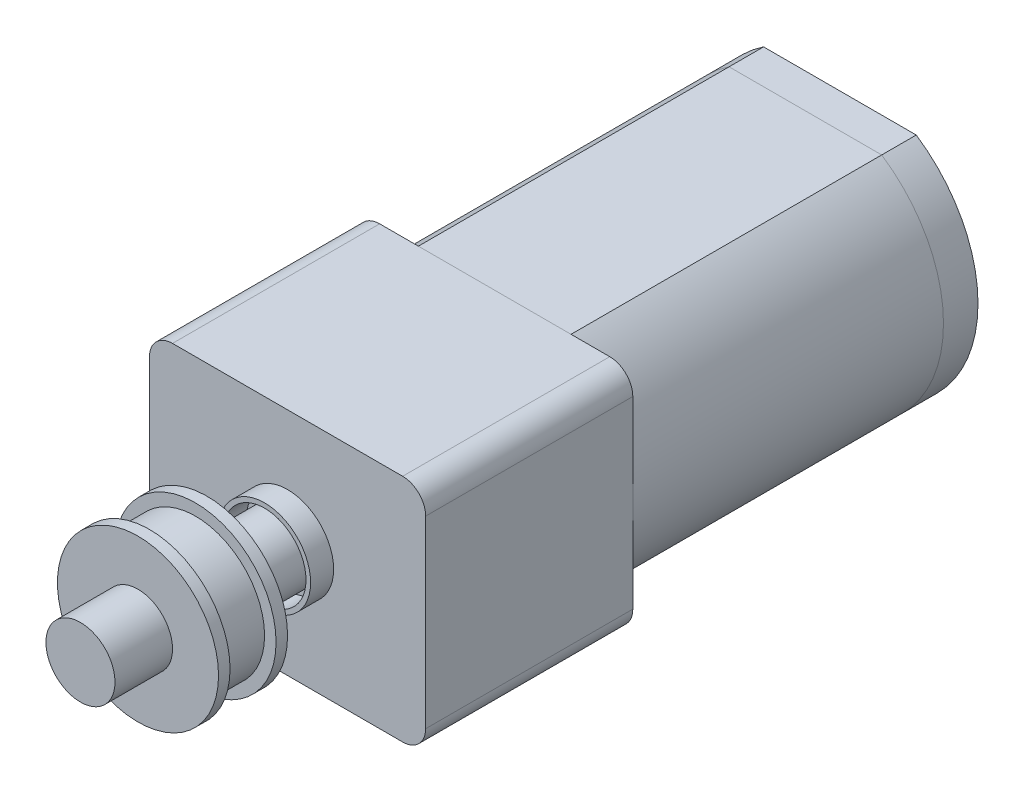
ISO-10303-21;
HEADER;
FILE_DESCRIPTION(('STEP AP214'),'2;1');
FILE_NAME('part.step','',(''),(''),'','','');
FILE_SCHEMA(('AUTOMOTIVE_DESIGN { 1 0 10303 214 1 1 1 1 }'));
ENDSEC;
DATA;
#1=APPLICATION_CONTEXT('core data for automotive mechanical design processes');
#2=APPLICATION_PROTOCOL_DEFINITION('international standard','automotive_design',2000,#1);
#3=PRODUCT_CONTEXT('',#1,'mechanical');
#4=PRODUCT('Part','Part','',(#3));
#5=PRODUCT_RELATED_PRODUCT_CATEGORY('part','',(#4));
#6=PRODUCT_DEFINITION_FORMATION('','',#4);
#7=PRODUCT_DEFINITION_CONTEXT('part definition',#1,'design');
#8=PRODUCT_DEFINITION('design','',#6,#7);
#9=PRODUCT_DEFINITION_SHAPE('','',#8);
#10=(LENGTH_UNIT() NAMED_UNIT(*) SI_UNIT(.MILLI.,.METRE.));
#11=(NAMED_UNIT(*) PLANE_ANGLE_UNIT() SI_UNIT($,.RADIAN.));
#12=(NAMED_UNIT(*) SI_UNIT($,.STERADIAN.) SOLID_ANGLE_UNIT());
#13=UNCERTAINTY_MEASURE_WITH_UNIT(LENGTH_MEASURE(1.E-05),#10,'distance_accuracy_value','');
#14=(GEOMETRIC_REPRESENTATION_CONTEXT(3) GLOBAL_UNCERTAINTY_ASSIGNED_CONTEXT((#13)) GLOBAL_UNIT_ASSIGNED_CONTEXT((#10,
#11,#12)) REPRESENTATION_CONTEXT('',''));
#15=CARTESIAN_POINT('',(0.,0.,0.));
#16=DIRECTION('',(0.,0.,1.));
#17=DIRECTION('',(1.,0.,0.));
#18=AXIS2_PLACEMENT_3D('',#15,#16,#17);
#19=CARTESIAN_POINT('',(0.,0.,26.));
#20=DIRECTION('',(0.,0.,-1.));
#21=DIRECTION('',(-1.,0.,0.));
#22=AXIS2_PLACEMENT_3D('',#19,#20,#21);
#23=PLANE('',#22);
#24=CARTESIAN_POINT('',(0.,0.,26.));
#25=DIRECTION('',(0.,0.,1.));
#26=DIRECTION('',(1.,0.,0.));
#27=AXIS2_PLACEMENT_3D('',#24,#25,#26);
#28=CIRCLE('',#27,3.5);
#29=CARTESIAN_POINT('',(3.5,0.,26.));
#30=VERTEX_POINT('',#29);
#31=EDGE_CURVE('E11',#30,#30,#28,.T.);
#32=ORIENTED_EDGE('',*,*,#31,.F.);
#33=EDGE_LOOP('',(#32));
#34=FACE_BOUND('',#33,.T.);
#35=ADVANCED_FACE('F50',(#34),#23,.T.);
#36=CARTESIAN_POINT('',(0.,0.,31.5));
#37=DIRECTION('',(0.,0.,1.));
#38=DIRECTION('',(1.,0.,0.));
#39=AXIS2_PLACEMENT_3D('',#36,#37,#38);
#40=CYLINDRICAL_SURFACE('',#39,3.5);
#41=ORIENTED_EDGE('',*,*,#31,.T.);
#42=EDGE_LOOP('',(#41));
#43=FACE_BOUND('',#42,.T.);
#44=CARTESIAN_POINT('',(0.,0.,26.5));
#45=DIRECTION('',(0.,0.,1.));
#46=DIRECTION('',(1.,0.,0.));
#47=AXIS2_PLACEMENT_3D('',#44,#45,#46);
#48=CIRCLE('',#47,3.5);
#49=CARTESIAN_POINT('',(3.5,0.,26.5));
#50=VERTEX_POINT('',#49);
#51=EDGE_CURVE('E56',#50,#50,#48,.T.);
#52=ORIENTED_EDGE('',*,*,#51,.F.);
#53=EDGE_LOOP('',(#52));
#54=FACE_BOUND('',#53,.T.);
#55=ADVANCED_FACE('F92',(#43,#54),#40,.T.);
#56=CARTESIAN_POINT('',(3.5,0.,26.5));
#57=DIRECTION('',(0.,0.,1.));
#58=DIRECTION('',(1.,0.,0.));
#59=AXIS2_PLACEMENT_3D('',#56,#57,#58);
#60=PLANE('',#59);
#61=ORIENTED_EDGE('',*,*,#51,.T.);
#62=EDGE_LOOP('',(#61));
#63=FACE_BOUND('',#62,.T.);
#64=CARTESIAN_POINT('',(0.,0.,26.5));
#65=DIRECTION('',(0.,0.,1.));
#66=DIRECTION('',(1.,0.,0.));
#67=AXIS2_PLACEMENT_3D('',#64,#65,#66);
#68=CIRCLE('',#67,3.);
#69=CARTESIAN_POINT('',(3.,0.,26.5));
#70=VERTEX_POINT('',#69);
#71=EDGE_CURVE('E60',#70,#70,#68,.T.);
#72=ORIENTED_EDGE('',*,*,#71,.F.);
#73=EDGE_LOOP('',(#72));
#74=FACE_BOUND('',#73,.T.);
#75=ADVANCED_FACE('F97',(#63,#74),#60,.T.);
#76=CARTESIAN_POINT('',(0.,0.,31.5));
#77=DIRECTION('',(0.,0.,1.));
#78=DIRECTION('',(1.,0.,0.));
#79=AXIS2_PLACEMENT_3D('',#76,#77,#78);
#80=CYLINDRICAL_SURFACE('',#79,3.);
#81=ORIENTED_EDGE('',*,*,#71,.T.);
#82=EDGE_LOOP('',(#81));
#83=FACE_BOUND('',#82,.T.);
#84=CARTESIAN_POINT('',(0.,0.,28.5));
#85=DIRECTION('',(0.,0.,1.));
#86=DIRECTION('',(1.,0.,0.));
#87=AXIS2_PLACEMENT_3D('',#84,#85,#86);
#88=CIRCLE('',#87,3.);
#89=CARTESIAN_POINT('',(3.,0.,28.5));
#90=VERTEX_POINT('',#89);
#91=EDGE_CURVE('E64',#90,#90,#88,.T.);
#92=ORIENTED_EDGE('',*,*,#91,.F.);
#93=EDGE_LOOP('',(#92));
#94=FACE_BOUND('',#93,.T.);
#95=ADVANCED_FACE('F88',(#83,#94),#80,.T.);
#96=CARTESIAN_POINT('',(3.5,0.,28.5));
#97=DIRECTION('',(0.,0.,-1.));
#98=DIRECTION('',(-1.,0.,0.));
#99=AXIS2_PLACEMENT_3D('',#96,#97,#98);
#100=PLANE('',#99);
#101=ORIENTED_EDGE('',*,*,#91,.T.);
#102=EDGE_LOOP('',(#101));
#103=FACE_BOUND('',#102,.T.);
#104=CARTESIAN_POINT('',(0.,0.,28.5));
#105=DIRECTION('',(0.,0.,1.));
#106=DIRECTION('',(1.,0.,0.));
#107=AXIS2_PLACEMENT_3D('',#104,#105,#106);
#108=CIRCLE('',#107,3.5);
#109=CARTESIAN_POINT('',(3.5,0.,28.5));
#110=VERTEX_POINT('',#109);
#111=EDGE_CURVE('E69',#110,#110,#108,.T.);
#112=ORIENTED_EDGE('',*,*,#111,.F.);
#113=EDGE_LOOP('',(#112));
#114=FACE_BOUND('',#113,.T.);
#115=ADVANCED_FACE('F80',(#103,#114),#100,.T.);
#116=CARTESIAN_POINT('',(0.,0.,31.5));
#117=DIRECTION('',(0.,0.,1.));
#118=DIRECTION('',(1.,0.,0.));
#119=AXIS2_PLACEMENT_3D('',#116,#117,#118);
#120=CYLINDRICAL_SURFACE('',#119,3.5);
#121=ORIENTED_EDGE('',*,*,#111,.T.);
#122=EDGE_LOOP('',(#121));
#123=FACE_BOUND('',#122,.T.);
#124=CARTESIAN_POINT('',(0.,0.,29.));
#125=DIRECTION('',(0.,0.,1.));
#126=DIRECTION('',(1.,0.,0.));
#127=AXIS2_PLACEMENT_3D('',#124,#125,#126);
#128=CIRCLE('',#127,3.5);
#129=CARTESIAN_POINT('',(3.5,0.,29.));
#130=VERTEX_POINT('',#129);
#131=EDGE_CURVE('E72',#130,#130,#128,.T.);
#132=ORIENTED_EDGE('',*,*,#131,.F.);
#133=EDGE_LOOP('',(#132));
#134=FACE_BOUND('',#133,.T.);
#135=ADVANCED_FACE('F78',(#123,#134),#120,.T.);
#136=CARTESIAN_POINT('',(0.,0.,29.));
#137=DIRECTION('',(0.,0.,1.));
#138=DIRECTION('',(1.,0.,0.));
#139=AXIS2_PLACEMENT_3D('',#136,#137,#138);
#140=PLANE('',#139);
#141=ORIENTED_EDGE('',*,*,#131,.T.);
#142=EDGE_LOOP('',(#141));
#143=FACE_BOUND('',#142,.T.);
#144=ADVANCED_FACE('F76',(#143),#140,.T.);
#145=CLOSED_SHELL('',(#35,#55,#75,#95,#115,#135,#144));
#146=MANIFOLD_SOLID_BREP('B2',#145);
#147=CARTESIAN_POINT('',(0.,0.,-1.5));
#148=DIRECTION('',(0.,0.,1.));
#149=DIRECTION('',(1.,0.,0.));
#150=AXIS2_PLACEMENT_3D('',#147,#148,#149);
#151=CYLINDRICAL_SURFACE('',#150,6.);
#152=CARTESIAN_POINT('',(0.,0.,0.));
#153=DIRECTION('',(0.,0.,-1.));
#154=DIRECTION('',(-1.,0.,0.));
#155=AXIS2_PLACEMENT_3D('',#152,#153,#154);
#156=CIRCLE('',#155,6.);
#157=CARTESIAN_POINT('',(-3.3166247903554,-5.,0.));
#158=VERTEX_POINT('',#157);
#159=CARTESIAN_POINT('',(-3.3166247903554,5.,0.));
#160=VERTEX_POINT('',#159);
#161=EDGE_CURVE('E224',#158,#160,#156,.T.);
#162=ORIENTED_EDGE('',*,*,#161,.T.);
#163=DIRECTION('',(0.,0.,1.));
#164=VECTOR('',#163,1.);
#165=CARTESIAN_POINT('',(-3.3166247903554,5.,-1.5));
#166=LINE('',#165,#164);
#167=CARTESIAN_POINT('',(-3.3166247903554,5.,-1.5));
#168=VERTEX_POINT('',#167);
#169=EDGE_CURVE('E166',#168,#160,#166,.T.);
#170=ORIENTED_EDGE('',*,*,#169,.F.);
#171=CARTESIAN_POINT('',(0.,0.,-1.5));
#172=DIRECTION('',(0.,0.,-1.));
#173=DIRECTION('',(-1.,0.,0.));
#174=AXIS2_PLACEMENT_3D('',#171,#172,#173);
#175=CIRCLE('',#174,6.);
#176=CARTESIAN_POINT('',(-3.3166247903554,-5.,-1.5));
#177=VERTEX_POINT('',#176);
#178=EDGE_CURVE('E210',#177,#168,#175,.T.);
#179=ORIENTED_EDGE('',*,*,#178,.F.);
#180=DIRECTION('',(0.,0.,1.));
#181=VECTOR('',#180,1.);
#182=CARTESIAN_POINT('',(-3.3166247903554,-5.,-1.5));
#183=LINE('',#182,#181);
#184=EDGE_CURVE('E220',#177,#158,#183,.T.);
#185=ORIENTED_EDGE('',*,*,#184,.T.);
#186=EDGE_LOOP('',(#162,#170,#179,#185));
#187=FACE_BOUND('',#186,.T.);
#188=ADVANCED_FACE('F158',(#187),#151,.T.);
#189=CARTESIAN_POINT('',(-3.3166247903554,5.,-1.5));
#190=DIRECTION('',(0.,-1.,0.));
#191=DIRECTION('',(1.,0.,0.));
#192=AXIS2_PLACEMENT_3D('',#189,#190,#191);
#193=PLANE('',#192);
#194=DIRECTION('',(1.,0.,0.));
#195=VECTOR('',#194,1.);
#196=CARTESIAN_POINT('',(-3.3166247903554,5.,0.));
#197=LINE('',#196,#195);
#198=CARTESIAN_POINT('',(3.3166247903554,5.,0.));
#199=VERTEX_POINT('',#198);
#200=EDGE_CURVE('E215',#160,#199,#197,.T.);
#201=ORIENTED_EDGE('',*,*,#200,.T.);
#202=DIRECTION('',(0.,0.,1.));
#203=VECTOR('',#202,1.);
#204=CARTESIAN_POINT('',(3.3166247903554,5.,-1.5));
#205=LINE('',#204,#203);
#206=CARTESIAN_POINT('',(3.3166247903554,5.,-1.5));
#207=VERTEX_POINT('',#206);
#208=EDGE_CURVE('E213',#207,#199,#205,.T.);
#209=ORIENTED_EDGE('',*,*,#208,.F.);
#210=DIRECTION('',(1.,0.,0.));
#211=VECTOR('',#210,1.);
#212=CARTESIAN_POINT('',(-3.3166247903554,5.,-1.5));
#213=LINE('',#212,#211);
#214=EDGE_CURVE('E205',#168,#207,#213,.T.);
#215=ORIENTED_EDGE('',*,*,#214,.F.);
#216=ORIENTED_EDGE('',*,*,#169,.T.);
#217=EDGE_LOOP('',(#201,#209,#215,#216));
#218=FACE_BOUND('',#217,.T.);
#219=ADVANCED_FACE('F214',(#218),#193,.F.);
#220=CARTESIAN_POINT('',(0.,0.,-1.5));
#221=DIRECTION('',(0.,0.,1.));
#222=DIRECTION('',(1.,0.,0.));
#223=AXIS2_PLACEMENT_3D('',#220,#221,#222);
#224=CYLINDRICAL_SURFACE('',#223,6.);
#225=CARTESIAN_POINT('',(0.,0.,0.));
#226=DIRECTION('',(0.,0.,-1.));
#227=DIRECTION('',(-1.,0.,0.));
#228=AXIS2_PLACEMENT_3D('',#225,#226,#227);
#229=CIRCLE('',#228,6.);
#230=CARTESIAN_POINT('',(3.3166247903554,-5.,0.));
#231=VERTEX_POINT('',#230);
#232=EDGE_CURVE('E191',#199,#231,#229,.T.);
#233=ORIENTED_EDGE('',*,*,#232,.T.);
#234=DIRECTION('',(0.,0.,1.));
#235=VECTOR('',#234,1.);
#236=CARTESIAN_POINT('',(3.3166247903554,-5.,-1.5));
#237=LINE('',#236,#235);
#238=CARTESIAN_POINT('',(3.3166247903554,-5.,-1.5));
#239=VERTEX_POINT('',#238);
#240=EDGE_CURVE('E216',#239,#231,#237,.T.);
#241=ORIENTED_EDGE('',*,*,#240,.F.);
#242=CARTESIAN_POINT('',(0.,0.,-1.5));
#243=DIRECTION('',(0.,0.,-1.));
#244=DIRECTION('',(-1.,0.,0.));
#245=AXIS2_PLACEMENT_3D('',#242,#243,#244);
#246=CIRCLE('',#245,6.);
#247=EDGE_CURVE('E208',#207,#239,#246,.T.);
#248=ORIENTED_EDGE('',*,*,#247,.F.);
#249=ORIENTED_EDGE('',*,*,#208,.T.);
#250=EDGE_LOOP('',(#233,#241,#248,#249));
#251=FACE_BOUND('',#250,.T.);
#252=ADVANCED_FACE('F218',(#251),#224,.T.);
#253=CARTESIAN_POINT('',(3.3166247903554,-5.,-1.5));
#254=DIRECTION('',(0.,1.,0.));
#255=DIRECTION('',(-1.,0.,0.));
#256=AXIS2_PLACEMENT_3D('',#253,#254,#255);
#257=PLANE('',#256);
#258=DIRECTION('',(-1.,0.,0.));
#259=VECTOR('',#258,1.);
#260=CARTESIAN_POINT('',(3.3166247903554,-5.,0.));
#261=LINE('',#260,#259);
#262=EDGE_CURVE('E197',#231,#158,#261,.T.);
#263=ORIENTED_EDGE('',*,*,#262,.T.);
#264=ORIENTED_EDGE('',*,*,#184,.F.);
#265=DIRECTION('',(-1.,0.,0.));
#266=VECTOR('',#265,1.);
#267=CARTESIAN_POINT('',(3.3166247903554,-5.,-1.5));
#268=LINE('',#267,#266);
#269=EDGE_CURVE('E174',#239,#177,#268,.T.);
#270=ORIENTED_EDGE('',*,*,#269,.F.);
#271=ORIENTED_EDGE('',*,*,#240,.T.);
#272=EDGE_LOOP('',(#263,#264,#270,#271));
#273=FACE_BOUND('',#272,.T.);
#274=ADVANCED_FACE('F246',(#273),#257,.F.);
#275=CARTESIAN_POINT('',(0.,0.,-1.5));
#276=DIRECTION('',(0.,0.,-1.));
#277=DIRECTION('',(-1.,0.,0.));
#278=AXIS2_PLACEMENT_3D('',#275,#276,#277);
#279=PLANE('',#278);
#280=CARTESIAN_POINT('',(0.,0.,-1.5));
#281=DIRECTION('',(0.,0.,-1.));
#282=DIRECTION('',(-1.,0.,0.));
#283=AXIS2_PLACEMENT_3D('',#280,#281,#282);
#284=CIRCLE('',#283,2.5);
#285=CARTESIAN_POINT('',(-2.5,0.,-1.5));
#286=VERTEX_POINT('',#285);
#287=EDGE_CURVE('E315',#286,#286,#284,.T.);
#288=ORIENTED_EDGE('',*,*,#287,.F.);
#289=EDGE_LOOP('',(#288));
#290=FACE_BOUND('',#289,.T.);
#291=ORIENTED_EDGE('',*,*,#178,.T.);
#292=ORIENTED_EDGE('',*,*,#214,.T.);
#293=ORIENTED_EDGE('',*,*,#247,.T.);
#294=ORIENTED_EDGE('',*,*,#269,.T.);
#295=EDGE_LOOP('',(#291,#292,#293,#294));
#296=FACE_BOUND('',#295,.T.);
#297=ADVANCED_FACE('F206',(#290,#296),#279,.T.);
#298=CARTESIAN_POINT('',(0.,0.,0.));
#299=DIRECTION('',(0.,0.,-1.));
#300=DIRECTION('',(-1.,0.,0.));
#301=AXIS2_PLACEMENT_3D('',#298,#299,#300);
#302=PLANE('',#301);
#303=ORIENTED_EDGE('',*,*,#161,.F.);
#304=ORIENTED_EDGE('',*,*,#262,.F.);
#305=ORIENTED_EDGE('',*,*,#232,.F.);
#306=ORIENTED_EDGE('',*,*,#200,.F.);
#307=EDGE_LOOP('',(#303,#304,#305,#306));
#308=FACE_BOUND('',#307,.T.);
#309=ADVANCED_FACE('F235',(#308),#302,.F.);
#310=CARTESIAN_POINT('',(0.,0.,-3.));
#311=DIRECTION('',(0.,0.,-1.));
#312=DIRECTION('',(-1.,0.,0.));
#313=AXIS2_PLACEMENT_3D('',#310,#311,#312);
#314=PLANE('',#313);
#315=CARTESIAN_POINT('',(0.,0.,-3.));
#316=DIRECTION('',(0.,0.,-1.));
#317=DIRECTION('',(-1.,0.,0.));
#318=AXIS2_PLACEMENT_3D('',#315,#316,#317);
#319=CIRCLE('',#318,2.5);
#320=CARTESIAN_POINT('',(-2.5,0.,-3.));
#321=VERTEX_POINT('',#320);
#322=EDGE_CURVE('E227',#321,#321,#319,.T.);
#323=ORIENTED_EDGE('',*,*,#322,.T.);
#324=EDGE_LOOP('',(#323));
#325=FACE_BOUND('',#324,.T.);
#326=CARTESIAN_POINT('',(0.,0.,-3.));
#327=DIRECTION('',(0.,0.,-1.));
#328=DIRECTION('',(-1.,0.,0.));
#329=AXIS2_PLACEMENT_3D('',#326,#327,#328);
#330=CIRCLE('',#329,1.5);
#331=CARTESIAN_POINT('',(-1.5,0.,-3.));
#332=VERTEX_POINT('',#331);
#333=EDGE_CURVE('E313',#332,#332,#330,.T.);
#334=ORIENTED_EDGE('',*,*,#333,.F.);
#335=EDGE_LOOP('',(#334));
#336=FACE_BOUND('',#335,.T.);
#337=ADVANCED_FACE('F237',(#325,#336),#314,.T.);
#338=CARTESIAN_POINT('',(0.,0.,-3.));
#339=DIRECTION('',(0.,0.,1.));
#340=DIRECTION('',(1.,0.,0.));
#341=AXIS2_PLACEMENT_3D('',#338,#339,#340);
#342=CYLINDRICAL_SURFACE('',#341,2.5);
#343=ORIENTED_EDGE('',*,*,#322,.F.);
#344=EDGE_LOOP('',(#343));
#345=FACE_BOUND('',#344,.T.);
#346=ORIENTED_EDGE('',*,*,#287,.T.);
#347=EDGE_LOOP('',(#346));
#348=FACE_BOUND('',#347,.T.);
#349=ADVANCED_FACE('F243',(#345,#348),#342,.T.);
#350=CARTESIAN_POINT('',(0.,0.,-3.));
#351=DIRECTION('',(0.,0.,1.));
#352=DIRECTION('',(1.,0.,0.));
#353=AXIS2_PLACEMENT_3D('',#350,#351,#352);
#354=CYLINDRICAL_SURFACE('',#353,1.5);
#355=ORIENTED_EDGE('',*,*,#333,.T.);
#356=EDGE_LOOP('',(#355));
#357=FACE_BOUND('',#356,.T.);
#358=CARTESIAN_POINT('',(0.,0.,-1.5));
#359=DIRECTION('',(0.,0.,-1.));
#360=DIRECTION('',(-1.,0.,0.));
#361=AXIS2_PLACEMENT_3D('',#358,#359,#360);
#362=CIRCLE('',#361,1.5);
#363=CARTESIAN_POINT('',(-1.5,0.,-1.5));
#364=VERTEX_POINT('',#363);
#365=EDGE_CURVE('E48',#364,#364,#362,.F.);
#366=ORIENTED_EDGE('',*,*,#365,.T.);
#367=EDGE_LOOP('',(#366));
#368=FACE_BOUND('',#367,.T.);
#369=ADVANCED_FACE('F286',(#357,#368),#354,.F.);
#370=ORIENTED_EDGE('',*,*,#365,.F.);
#371=EDGE_LOOP('',(#370));
#372=FACE_BOUND('',#371,.T.);
#373=ADVANCED_FACE('F249',(#372),#279,.T.);
#374=CLOSED_SHELL('',(#188,#219,#252,#274,#297,#309,#337,#349,#369,#373));
#375=MANIFOLD_SOLID_BREP('B6',#374);
#376=CARTESIAN_POINT('',(0.,0.,31.5));
#377=DIRECTION('',(0.,0.,-1.));
#378=DIRECTION('',(-1.,0.,0.));
#379=AXIS2_PLACEMENT_3D('',#376,#377,#378);
#380=CYLINDRICAL_SURFACE('',#379,1.5);
#381=CARTESIAN_POINT('',(0.,0.,31.5));
#382=DIRECTION('',(0.,0.,1.));
#383=DIRECTION('',(1.,0.,0.));
#384=AXIS2_PLACEMENT_3D('',#381,#382,#383);
#385=CIRCLE('',#384,1.5);
#386=CARTESIAN_POINT('',(1.5,0.,31.5));
#387=VERTEX_POINT('',#386);
#388=EDGE_CURVE('E157',#387,#387,#385,.T.);
#389=ORIENTED_EDGE('',*,*,#388,.F.);
#390=EDGE_LOOP('',(#389));
#391=FACE_BOUND('',#390,.T.);
#392=CARTESIAN_POINT('',(0.,0.,22.5));
#393=DIRECTION('',(0.,0.,1.));
#394=DIRECTION('',(1.,0.,0.));
#395=AXIS2_PLACEMENT_3D('',#392,#393,#394);
#396=CIRCLE('',#395,1.5);
#397=CARTESIAN_POINT('',(1.5,0.,22.5));
#398=VERTEX_POINT('',#397);
#399=EDGE_CURVE('E353',#398,#398,#396,.T.);
#400=ORIENTED_EDGE('',*,*,#399,.T.);
#401=EDGE_LOOP('',(#400));
#402=FACE_BOUND('',#401,.T.);
#403=ADVANCED_FACE('F350',(#391,#402),#380,.T.);
#404=CARTESIAN_POINT('',(0.,0.,31.5));
#405=DIRECTION('',(0.,0.,1.));
#406=DIRECTION('',(1.,0.,0.));
#407=AXIS2_PLACEMENT_3D('',#404,#405,#406);
#408=PLANE('',#407);
#409=ORIENTED_EDGE('',*,*,#388,.T.);
#410=EDGE_LOOP('',(#409));
#411=FACE_BOUND('',#410,.T.);
#412=ADVANCED_FACE('F365',(#411),#408,.T.);
#413=CARTESIAN_POINT('',(0.,0.,22.5));
#414=DIRECTION('',(0.,0.,1.));
#415=DIRECTION('',(1.,0.,0.));
#416=AXIS2_PLACEMENT_3D('',#413,#414,#415);
#417=PLANE('',#416);
#418=ORIENTED_EDGE('',*,*,#399,.F.);
#419=EDGE_LOOP('',(#418));
#420=FACE_BOUND('',#419,.T.);
#421=ADVANCED_FACE('F363',(#420),#417,.F.);
#422=CLOSED_SHELL('',(#403,#412,#421));
#423=MANIFOLD_SOLID_BREP('B42',#422);
#424=CARTESIAN_POINT('',(-6.,-5.,22.5));
#425=DIRECTION('',(1.,0.,0.));
#426=DIRECTION('',(0.,0.,-1.));
#427=AXIS2_PLACEMENT_3D('',#424,#425,#426);
#428=PLANE('',#427);
#429=DIRECTION('',(0.,-1.,0.));
#430=VECTOR('',#429,1.);
#431=CARTESIAN_POINT('',(-6.,-5.,13.5));
#432=LINE('',#431,#430);
#433=CARTESIAN_POINT('',(-6.,4.,13.5));
#434=VERTEX_POINT('',#433);
#435=CARTESIAN_POINT('',(-6.,-4.,13.5));
#436=VERTEX_POINT('',#435);
#437=EDGE_CURVE('E494',#434,#436,#432,.T.);
#438=ORIENTED_EDGE('',*,*,#437,.T.);
#439=DIRECTION('',(0.,0.,-1.));
#440=VECTOR('',#439,1.);
#441=CARTESIAN_POINT('',(-6.,-4.,22.5));
#442=LINE('',#441,#440);
#443=CARTESIAN_POINT('',(-6.,-4.,22.5));
#444=VERTEX_POINT('',#443);
#445=EDGE_CURVE('E520',#436,#444,#442,.F.);
#446=ORIENTED_EDGE('',*,*,#445,.T.);
#447=DIRECTION('',(0.,-1.,0.));
#448=VECTOR('',#447,1.);
#449=CARTESIAN_POINT('',(-6.,-5.,22.5));
#450=LINE('',#449,#448);
#451=CARTESIAN_POINT('',(-6.,4.,22.5));
#452=VERTEX_POINT('',#451);
#453=EDGE_CURVE('E492',#452,#444,#450,.T.);
#454=ORIENTED_EDGE('',*,*,#453,.F.);
#455=DIRECTION('',(0.,0.,-1.));
#456=VECTOR('',#455,1.);
#457=CARTESIAN_POINT('',(-6.,4.,22.5));
#458=LINE('',#457,#456);
#459=EDGE_CURVE('E517',#452,#434,#458,.T.);
#460=ORIENTED_EDGE('',*,*,#459,.T.);
#461=EDGE_LOOP('',(#438,#446,#454,#460));
#462=FACE_BOUND('',#461,.T.);
#463=ADVANCED_FACE('F399',(#462),#428,.F.);
#464=CARTESIAN_POINT('',(6.,-5.,22.5));
#465=DIRECTION('',(0.,1.,0.));
#466=DIRECTION('',(0.,0.,1.));
#467=AXIS2_PLACEMENT_3D('',#464,#465,#466);
#468=PLANE('',#467);
#469=DIRECTION('',(1.,0.,0.));
#470=VECTOR('',#469,1.);
#471=CARTESIAN_POINT('',(6.,-5.,13.5));
#472=LINE('',#471,#470);
#473=CARTESIAN_POINT('',(-5.,-5.,13.5));
#474=VERTEX_POINT('',#473);
#475=CARTESIAN_POINT('',(5.,-5.,13.5));
#476=VERTEX_POINT('',#475);
#477=EDGE_CURVE('E490',#474,#476,#472,.T.);
#478=ORIENTED_EDGE('',*,*,#477,.T.);
#479=DIRECTION('',(0.,0.,-1.));
#480=VECTOR('',#479,1.);
#481=CARTESIAN_POINT('',(5.,-5.,22.5));
#482=LINE('',#481,#480);
#483=CARTESIAN_POINT('',(5.,-5.,22.5));
#484=VERTEX_POINT('',#483);
#485=EDGE_CURVE('E469',#476,#484,#482,.F.);
#486=ORIENTED_EDGE('',*,*,#485,.T.);
#487=DIRECTION('',(1.,0.,0.));
#488=VECTOR('',#487,1.);
#489=CARTESIAN_POINT('',(6.,-5.,22.5));
#490=LINE('',#489,#488);
#491=CARTESIAN_POINT('',(-5.,-5.,22.5));
#492=VERTEX_POINT('',#491);
#493=EDGE_CURVE('E536',#492,#484,#490,.T.);
#494=ORIENTED_EDGE('',*,*,#493,.F.);
#495=DIRECTION('',(0.,0.,-1.));
#496=VECTOR('',#495,1.);
#497=CARTESIAN_POINT('',(-5.,-5.,22.5));
#498=LINE('',#497,#496);
#499=EDGE_CURVE('E474',#492,#474,#498,.T.);
#500=ORIENTED_EDGE('',*,*,#499,.T.);
#501=EDGE_LOOP('',(#478,#486,#494,#500));
#502=FACE_BOUND('',#501,.T.);
#503=ADVANCED_FACE('F572',(#502),#468,.F.);
#504=CARTESIAN_POINT('',(6.,-5.,22.5));
#505=DIRECTION('',(-1.,0.,0.));
#506=DIRECTION('',(0.,0.,1.));
#507=AXIS2_PLACEMENT_3D('',#504,#505,#506);
#508=PLANE('',#507);
#509=DIRECTION('',(0.,1.,0.));
#510=VECTOR('',#509,1.);
#511=CARTESIAN_POINT('',(6.,-5.,22.5));
#512=LINE('',#511,#510);
#513=CARTESIAN_POINT('',(6.,-4.,22.5));
#514=VERTEX_POINT('',#513);
#515=CARTESIAN_POINT('',(6.,4.,22.5));
#516=VERTEX_POINT('',#515);
#517=EDGE_CURVE('E483',#514,#516,#512,.T.);
#518=ORIENTED_EDGE('',*,*,#517,.F.);
#519=DIRECTION('',(0.,0.,-1.));
#520=VECTOR('',#519,1.);
#521=CARTESIAN_POINT('',(6.,-4.,22.5));
#522=LINE('',#521,#520);
#523=CARTESIAN_POINT('',(6.,-4.,13.5));
#524=VERTEX_POINT('',#523);
#525=EDGE_CURVE('E468',#514,#524,#522,.T.);
#526=ORIENTED_EDGE('',*,*,#525,.T.);
#527=DIRECTION('',(0.,1.,0.));
#528=VECTOR('',#527,1.);
#529=CARTESIAN_POINT('',(6.,-5.,13.5));
#530=LINE('',#529,#528);
#531=CARTESIAN_POINT('',(6.,4.,13.5));
#532=VERTEX_POINT('',#531);
#533=EDGE_CURVE('E481',#524,#532,#530,.T.);
#534=ORIENTED_EDGE('',*,*,#533,.T.);
#535=DIRECTION('',(0.,0.,-1.));
#536=VECTOR('',#535,1.);
#537=CARTESIAN_POINT('',(6.,4.,22.5));
#538=LINE('',#537,#536);
#539=EDGE_CURVE('E485',#532,#516,#538,.F.);
#540=ORIENTED_EDGE('',*,*,#539,.T.);
#541=EDGE_LOOP('',(#518,#526,#534,#540));
#542=FACE_BOUND('',#541,.T.);
#543=ADVANCED_FACE('F480',(#542),#508,.F.);
#544=CARTESIAN_POINT('',(6.,5.,22.5));
#545=DIRECTION('',(0.,-1.,0.));
#546=DIRECTION('',(0.,0.,-1.));
#547=AXIS2_PLACEMENT_3D('',#544,#545,#546);
#548=PLANE('',#547);
#549=DIRECTION('',(-1.,0.,0.));
#550=VECTOR('',#549,1.);
#551=CARTESIAN_POINT('',(6.,5.,13.5));
#552=LINE('',#551,#550);
#553=CARTESIAN_POINT('',(5.,5.,13.5));
#554=VERTEX_POINT('',#553);
#555=CARTESIAN_POINT('',(-5.,5.,13.5));
#556=VERTEX_POINT('',#555);
#557=EDGE_CURVE('E489',#554,#556,#552,.T.);
#558=ORIENTED_EDGE('',*,*,#557,.T.);
#559=DIRECTION('',(0.,0.,-1.));
#560=VECTOR('',#559,1.);
#561=CARTESIAN_POINT('',(-5.,5.,22.5));
#562=LINE('',#561,#560);
#563=CARTESIAN_POINT('',(-5.,5.,22.5));
#564=VERTEX_POINT('',#563);
#565=EDGE_CURVE('E348',#556,#564,#562,.F.);
#566=ORIENTED_EDGE('',*,*,#565,.T.);
#567=DIRECTION('',(-1.,0.,0.));
#568=VECTOR('',#567,1.);
#569=CARTESIAN_POINT('',(6.,5.,22.5));
#570=LINE('',#569,#568);
#571=CARTESIAN_POINT('',(5.,5.,22.5));
#572=VERTEX_POINT('',#571);
#573=EDGE_CURVE('E501',#572,#564,#570,.T.);
#574=ORIENTED_EDGE('',*,*,#573,.F.);
#575=DIRECTION('',(0.,0.,-1.));
#576=VECTOR('',#575,1.);
#577=CARTESIAN_POINT('',(5.,5.,22.5));
#578=LINE('',#577,#576);
#579=EDGE_CURVE('E407',#572,#554,#578,.T.);
#580=ORIENTED_EDGE('',*,*,#579,.T.);
#581=EDGE_LOOP('',(#558,#566,#574,#580));
#582=FACE_BOUND('',#581,.T.);
#583=ADVANCED_FACE('F523',(#582),#548,.F.);
#584=CARTESIAN_POINT('',(0.,0.,22.5));
#585=DIRECTION('',(0.,0.,1.));
#586=DIRECTION('',(1.,0.,0.));
#587=AXIS2_PLACEMENT_3D('',#584,#585,#586);
#588=PLANE('',#587);
#589=CARTESIAN_POINT('',(0.,0.,22.5));
#590=DIRECTION('',(0.,0.,1.));
#591=DIRECTION('',(1.,0.,0.));
#592=AXIS2_PLACEMENT_3D('',#589,#590,#591);
#593=CIRCLE('',#592,2.);
#594=CARTESIAN_POINT('',(2.,0.,22.5));
#595=VERTEX_POINT('',#594);
#596=EDGE_CURVE('E541',#595,#595,#593,.T.);
#597=ORIENTED_EDGE('',*,*,#596,.F.);
#598=EDGE_LOOP('',(#597));
#599=FACE_BOUND('',#598,.T.);
#600=ORIENTED_EDGE('',*,*,#493,.T.);
#601=CARTESIAN_POINT('',(5.,-4.,22.5));
#602=DIRECTION('',(0.,0.,1.));
#603=DIRECTION('',(1.,0.,0.));
#604=AXIS2_PLACEMENT_3D('',#601,#602,#603);
#605=CIRCLE('',#604,1.);
#606=EDGE_CURVE('E515',#484,#514,#605,.T.);
#607=ORIENTED_EDGE('',*,*,#606,.T.);
#608=ORIENTED_EDGE('',*,*,#517,.T.);
#609=CARTESIAN_POINT('',(5.,4.,22.5));
#610=DIRECTION('',(0.,0.,1.));
#611=DIRECTION('',(1.,0.,0.));
#612=AXIS2_PLACEMENT_3D('',#609,#610,#611);
#613=CIRCLE('',#612,1.);
#614=EDGE_CURVE('E419',#516,#572,#613,.T.);
#615=ORIENTED_EDGE('',*,*,#614,.T.);
#616=ORIENTED_EDGE('',*,*,#573,.T.);
#617=CARTESIAN_POINT('',(-5.,4.,22.5));
#618=DIRECTION('',(0.,0.,1.));
#619=DIRECTION('',(1.,0.,0.));
#620=AXIS2_PLACEMENT_3D('',#617,#618,#619);
#621=CIRCLE('',#620,1.);
#622=EDGE_CURVE('E511',#564,#452,#621,.T.);
#623=ORIENTED_EDGE('',*,*,#622,.T.);
#624=ORIENTED_EDGE('',*,*,#453,.T.);
#625=CARTESIAN_POINT('',(-5.,-4.,22.5));
#626=DIRECTION('',(0.,0.,1.));
#627=DIRECTION('',(1.,0.,0.));
#628=AXIS2_PLACEMENT_3D('',#625,#626,#627);
#629=CIRCLE('',#628,1.);
#630=EDGE_CURVE('E513',#444,#492,#629,.T.);
#631=ORIENTED_EDGE('',*,*,#630,.T.);
#632=EDGE_LOOP('',(#600,#607,#608,#615,#616,#623,#624,#631));
#633=FACE_BOUND('',#632,.T.);
#634=ADVANCED_FACE('F568',(#599,#633),#588,.T.);
#635=CARTESIAN_POINT('',(0.,0.,13.5));
#636=DIRECTION('',(0.,0.,1.));
#637=DIRECTION('',(1.,0.,0.));
#638=AXIS2_PLACEMENT_3D('',#635,#636,#637);
#639=PLANE('',#638);
#640=ORIENTED_EDGE('',*,*,#533,.F.);
#641=CARTESIAN_POINT('',(5.,-4.,13.5));
#642=DIRECTION('',(0.,0.,1.));
#643=DIRECTION('',(1.,0.,0.));
#644=AXIS2_PLACEMENT_3D('',#641,#642,#643);
#645=CIRCLE('',#644,1.);
#646=EDGE_CURVE('E464',#524,#476,#645,.F.);
#647=ORIENTED_EDGE('',*,*,#646,.T.);
#648=ORIENTED_EDGE('',*,*,#477,.F.);
#649=CARTESIAN_POINT('',(-5.,-4.,13.5));
#650=DIRECTION('',(0.,0.,1.));
#651=DIRECTION('',(1.,0.,0.));
#652=AXIS2_PLACEMENT_3D('',#649,#650,#651);
#653=CIRCLE('',#652,1.);
#654=EDGE_CURVE('E475',#474,#436,#653,.F.);
#655=ORIENTED_EDGE('',*,*,#654,.T.);
#656=ORIENTED_EDGE('',*,*,#437,.F.);
#657=CARTESIAN_POINT('',(-5.,4.,13.5));
#658=DIRECTION('',(0.,0.,1.));
#659=DIRECTION('',(1.,0.,0.));
#660=AXIS2_PLACEMENT_3D('',#657,#658,#659);
#661=CIRCLE('',#660,1.);
#662=EDGE_CURVE('E504',#434,#556,#661,.F.);
#663=ORIENTED_EDGE('',*,*,#662,.T.);
#664=ORIENTED_EDGE('',*,*,#557,.F.);
#665=CARTESIAN_POINT('',(5.,4.,13.5));
#666=DIRECTION('',(0.,0.,1.));
#667=DIRECTION('',(1.,0.,0.));
#668=AXIS2_PLACEMENT_3D('',#665,#666,#667);
#669=CIRCLE('',#668,1.);
#670=EDGE_CURVE('E484',#554,#532,#669,.F.);
#671=ORIENTED_EDGE('',*,*,#670,.T.);
#672=EDGE_LOOP('',(#640,#647,#648,#655,#656,#663,#664,#671));
#673=FACE_BOUND('',#672,.T.);
#674=ADVANCED_FACE('F487',(#673),#639,.F.);
#675=CARTESIAN_POINT('',(0.,0.,23.5));
#676=DIRECTION('',(0.,0.,1.));
#677=DIRECTION('',(1.,0.,0.));
#678=AXIS2_PLACEMENT_3D('',#675,#676,#677);
#679=PLANE('',#678);
#680=CARTESIAN_POINT('',(0.,0.,23.5));
#681=DIRECTION('',(0.,0.,1.));
#682=DIRECTION('',(1.,0.,0.));
#683=AXIS2_PLACEMENT_3D('',#680,#681,#682);
#684=CIRCLE('',#683,2.);
#685=CARTESIAN_POINT('',(2.,0.,23.5));
#686=VERTEX_POINT('',#685);
#687=EDGE_CURVE('E545',#686,#686,#684,.T.);
#688=ORIENTED_EDGE('',*,*,#687,.T.);
#689=EDGE_LOOP('',(#688));
#690=FACE_BOUND('',#689,.T.);
#691=CARTESIAN_POINT('',(0.,0.,23.5));
#692=DIRECTION('',(0.,0.,1.));
#693=DIRECTION('',(1.,0.,0.));
#694=AXIS2_PLACEMENT_3D('',#691,#692,#693);
#695=CIRCLE('',#694,1.8);
#696=CARTESIAN_POINT('',(1.8,0.,23.5));
#697=VERTEX_POINT('',#696);
#698=EDGE_CURVE('E550',#697,#697,#695,.T.);
#699=ORIENTED_EDGE('',*,*,#698,.F.);
#700=EDGE_LOOP('',(#699));
#701=FACE_BOUND('',#700,.T.);
#702=ADVANCED_FACE('F558',(#690,#701),#679,.T.);
#703=CARTESIAN_POINT('',(0.,0.,23.5));
#704=DIRECTION('',(0.,0.,-1.));
#705=DIRECTION('',(-1.,0.,0.));
#706=AXIS2_PLACEMENT_3D('',#703,#704,#705);
#707=CYLINDRICAL_SURFACE('',#706,2.);
#708=ORIENTED_EDGE('',*,*,#687,.F.);
#709=EDGE_LOOP('',(#708));
#710=FACE_BOUND('',#709,.T.);
#711=ORIENTED_EDGE('',*,*,#596,.T.);
#712=EDGE_LOOP('',(#711));
#713=FACE_BOUND('',#712,.T.);
#714=ADVANCED_FACE('F560',(#710,#713),#707,.T.);
#715=CARTESIAN_POINT('',(0.,0.,23.5));
#716=DIRECTION('',(0.,0.,-1.));
#717=DIRECTION('',(-1.,0.,0.));
#718=AXIS2_PLACEMENT_3D('',#715,#716,#717);
#719=CYLINDRICAL_SURFACE('',#718,1.8);
#720=ORIENTED_EDGE('',*,*,#698,.T.);
#721=EDGE_LOOP('',(#720));
#722=FACE_BOUND('',#721,.T.);
#723=CARTESIAN_POINT('',(0.,0.,22.5));
#724=DIRECTION('',(0.,0.,1.));
#725=DIRECTION('',(1.,0.,0.));
#726=AXIS2_PLACEMENT_3D('',#723,#724,#725);
#727=CIRCLE('',#726,1.8);
#728=CARTESIAN_POINT('',(1.8,0.,22.5));
#729=VERTEX_POINT('',#728);
#730=EDGE_CURVE('E498',#729,#729,#727,.F.);
#731=ORIENTED_EDGE('',*,*,#730,.T.);
#732=EDGE_LOOP('',(#731));
#733=FACE_BOUND('',#732,.T.);
#734=ADVANCED_FACE('F555',(#722,#733),#719,.F.);
#735=ORIENTED_EDGE('',*,*,#730,.F.);
#736=EDGE_LOOP('',(#735));
#737=FACE_BOUND('',#736,.T.);
#738=ADVANCED_FACE('F584',(#737),#588,.T.);
#739=CARTESIAN_POINT('',(5.,-4.,22.5));
#740=DIRECTION('',(0.,0.,-1.));
#741=DIRECTION('',(-1.,0.,0.));
#742=AXIS2_PLACEMENT_3D('',#739,#740,#741);
#743=CYLINDRICAL_SURFACE('',#742,1.);
#744=ORIENTED_EDGE('',*,*,#606,.F.);
#745=ORIENTED_EDGE('',*,*,#485,.F.);
#746=ORIENTED_EDGE('',*,*,#646,.F.);
#747=ORIENTED_EDGE('',*,*,#525,.F.);
#748=EDGE_LOOP('',(#744,#745,#746,#747));
#749=FACE_BOUND('',#748,.T.);
#750=ADVANCED_FACE('F467',(#749),#743,.T.);
#751=CARTESIAN_POINT('',(-5.,-4.,22.5));
#752=DIRECTION('',(0.,0.,-1.));
#753=DIRECTION('',(-1.,0.,0.));
#754=AXIS2_PLACEMENT_3D('',#751,#752,#753);
#755=CYLINDRICAL_SURFACE('',#754,1.);
#756=ORIENTED_EDGE('',*,*,#630,.F.);
#757=ORIENTED_EDGE('',*,*,#445,.F.);
#758=ORIENTED_EDGE('',*,*,#654,.F.);
#759=ORIENTED_EDGE('',*,*,#499,.F.);
#760=EDGE_LOOP('',(#756,#757,#758,#759));
#761=FACE_BOUND('',#760,.T.);
#762=ADVANCED_FACE('F583',(#761),#755,.T.);
#763=CARTESIAN_POINT('',(-5.,4.,22.5));
#764=DIRECTION('',(0.,0.,-1.));
#765=DIRECTION('',(-1.,0.,0.));
#766=AXIS2_PLACEMENT_3D('',#763,#764,#765);
#767=CYLINDRICAL_SURFACE('',#766,1.);
#768=ORIENTED_EDGE('',*,*,#622,.F.);
#769=ORIENTED_EDGE('',*,*,#565,.F.);
#770=ORIENTED_EDGE('',*,*,#662,.F.);
#771=ORIENTED_EDGE('',*,*,#459,.F.);
#772=EDGE_LOOP('',(#768,#769,#770,#771));
#773=FACE_BOUND('',#772,.T.);
#774=ADVANCED_FACE('F530',(#773),#767,.T.);
#775=CARTESIAN_POINT('',(5.,4.,22.5));
#776=DIRECTION('',(0.,0.,-1.));
#777=DIRECTION('',(-1.,0.,0.));
#778=AXIS2_PLACEMENT_3D('',#775,#776,#777);
#779=CYLINDRICAL_SURFACE('',#778,1.);
#780=ORIENTED_EDGE('',*,*,#614,.F.);
#781=ORIENTED_EDGE('',*,*,#539,.F.);
#782=ORIENTED_EDGE('',*,*,#670,.F.);
#783=ORIENTED_EDGE('',*,*,#579,.F.);
#784=EDGE_LOOP('',(#780,#781,#782,#783));
#785=FACE_BOUND('',#784,.T.);
#786=ADVANCED_FACE('F401',(#785),#779,.T.);
#787=CLOSED_SHELL('',(#463,#503,#543,#583,#634,#674,#702,#714,#734,#738,#750,#762,#774,#786));
#788=MANIFOLD_SOLID_BREP('B152',#787);
#789=CARTESIAN_POINT('',(0.,0.,13.5));
#790=DIRECTION('',(0.,0.,-1.));
#791=DIRECTION('',(-1.,0.,0.));
#792=AXIS2_PLACEMENT_3D('',#789,#790,#791);
#793=CYLINDRICAL_SURFACE('',#792,6.);
#794=CARTESIAN_POINT('',(0.,0.,0.));
#795=DIRECTION('',(0.,0.,1.));
#796=DIRECTION('',(1.,0.,0.));
#797=AXIS2_PLACEMENT_3D('',#794,#795,#796);
#798=CIRCLE('',#797,6.);
#799=CARTESIAN_POINT('',(-3.3166247903554,5.,0.));
#800=VERTEX_POINT('',#799);
#801=CARTESIAN_POINT('',(-3.3166247903554,-5.,0.));
#802=VERTEX_POINT('',#801);
#803=EDGE_CURVE('E748',#800,#802,#798,.T.);
#804=ORIENTED_EDGE('',*,*,#803,.T.);
#805=DIRECTION('',(0.,0.,-1.));
#806=VECTOR('',#805,1.);
#807=CARTESIAN_POINT('',(-3.3166247903554,-5.,13.5));
#808=LINE('',#807,#806);
#809=CARTESIAN_POINT('',(-3.3166247903554,-5.,13.5));
#810=VERTEX_POINT('',#809);
#811=EDGE_CURVE('E397',#810,#802,#808,.T.);
#812=ORIENTED_EDGE('',*,*,#811,.F.);
#813=CARTESIAN_POINT('',(0.,0.,13.5));
#814=DIRECTION('',(0.,0.,1.));
#815=DIRECTION('',(1.,0.,0.));
#816=AXIS2_PLACEMENT_3D('',#813,#814,#815);
#817=CIRCLE('',#816,6.);
#818=CARTESIAN_POINT('',(-3.3166247903554,5.,13.5));
#819=VERTEX_POINT('',#818);
#820=EDGE_CURVE('E727',#819,#810,#817,.T.);
#821=ORIENTED_EDGE('',*,*,#820,.F.);
#822=DIRECTION('',(0.,0.,-1.));
#823=VECTOR('',#822,1.);
#824=CARTESIAN_POINT('',(-3.3166247903554,5.,13.5));
#825=LINE('',#824,#823);
#826=EDGE_CURVE('E747',#819,#800,#825,.T.);
#827=ORIENTED_EDGE('',*,*,#826,.T.);
#828=EDGE_LOOP('',(#804,#812,#821,#827));
#829=FACE_BOUND('',#828,.T.);
#830=ADVANCED_FACE('F685',(#829),#793,.T.);
#831=CARTESIAN_POINT('',(0.,-5.,13.5));
#832=DIRECTION('',(0.,-1.,0.));
#833=DIRECTION('',(0.,0.,-1.));
#834=AXIS2_PLACEMENT_3D('',#831,#832,#833);
#835=PLANE('',#834);
#836=DIRECTION('',(-1.,0.,0.));
#837=VECTOR('',#836,1.);
#838=CARTESIAN_POINT('',(0.,-5.,0.));
#839=LINE('',#838,#837);
#840=CARTESIAN_POINT('',(3.3166247903554,-5.,0.));
#841=VERTEX_POINT('',#840);
#842=EDGE_CURVE('E737',#841,#802,#839,.T.);
#843=ORIENTED_EDGE('',*,*,#842,.F.);
#844=DIRECTION('',(0.,0.,-1.));
#845=VECTOR('',#844,1.);
#846=CARTESIAN_POINT('',(3.3166247903554,-5.,13.5));
#847=LINE('',#846,#845);
#848=CARTESIAN_POINT('',(3.3166247903554,-5.,13.5));
#849=VERTEX_POINT('',#848);
#850=EDGE_CURVE('E693',#849,#841,#847,.T.);
#851=ORIENTED_EDGE('',*,*,#850,.F.);
#852=DIRECTION('',(-1.,0.,0.));
#853=VECTOR('',#852,1.);
#854=CARTESIAN_POINT('',(0.,-5.,13.5));
#855=LINE('',#854,#853);
#856=EDGE_CURVE('E735',#849,#810,#855,.T.);
#857=ORIENTED_EDGE('',*,*,#856,.T.);
#858=ORIENTED_EDGE('',*,*,#811,.T.);
#859=EDGE_LOOP('',(#843,#851,#857,#858));
#860=FACE_BOUND('',#859,.T.);
#861=ADVANCED_FACE('F734',(#860),#835,.T.);
#862=CARTESIAN_POINT('',(0.,0.,13.5));
#863=DIRECTION('',(0.,0.,-1.));
#864=DIRECTION('',(-1.,0.,0.));
#865=AXIS2_PLACEMENT_3D('',#862,#863,#864);
#866=CYLINDRICAL_SURFACE('',#865,6.);
#867=CARTESIAN_POINT('',(0.,0.,0.));
#868=DIRECTION('',(0.,0.,1.));
#869=DIRECTION('',(1.,0.,0.));
#870=AXIS2_PLACEMENT_3D('',#867,#868,#869);
#871=CIRCLE('',#870,6.);
#872=CARTESIAN_POINT('',(3.3166247903554,5.,0.));
#873=VERTEX_POINT('',#872);
#874=EDGE_CURVE('E716',#841,#873,#871,.T.);
#875=ORIENTED_EDGE('',*,*,#874,.T.);
#876=DIRECTION('',(0.,0.,-1.));
#877=VECTOR('',#876,1.);
#878=CARTESIAN_POINT('',(3.3166247903554,5.,13.5));
#879=LINE('',#878,#877);
#880=CARTESIAN_POINT('',(3.3166247903554,5.,13.5));
#881=VERTEX_POINT('',#880);
#882=EDGE_CURVE('E738',#881,#873,#879,.T.);
#883=ORIENTED_EDGE('',*,*,#882,.F.);
#884=CARTESIAN_POINT('',(0.,0.,13.5));
#885=DIRECTION('',(0.,0.,1.));
#886=DIRECTION('',(1.,0.,0.));
#887=AXIS2_PLACEMENT_3D('',#884,#885,#886);
#888=CIRCLE('',#887,6.);
#889=EDGE_CURVE('E739',#849,#881,#888,.T.);
#890=ORIENTED_EDGE('',*,*,#889,.F.);
#891=ORIENTED_EDGE('',*,*,#850,.T.);
#892=EDGE_LOOP('',(#875,#883,#890,#891));
#893=FACE_BOUND('',#892,.T.);
#894=ADVANCED_FACE('F740',(#893),#866,.T.);
#895=CARTESIAN_POINT('',(0.,5.,13.5));
#896=DIRECTION('',(0.,-1.,0.));
#897=DIRECTION('',(0.,0.,-1.));
#898=AXIS2_PLACEMENT_3D('',#895,#896,#897);
#899=PLANE('',#898);
#900=DIRECTION('',(-1.,0.,0.));
#901=VECTOR('',#900,1.);
#902=CARTESIAN_POINT('',(0.,5.,0.));
#903=LINE('',#902,#901);
#904=EDGE_CURVE('E722',#873,#800,#903,.T.);
#905=ORIENTED_EDGE('',*,*,#904,.T.);
#906=ORIENTED_EDGE('',*,*,#826,.F.);
#907=DIRECTION('',(-1.,0.,0.));
#908=VECTOR('',#907,1.);
#909=CARTESIAN_POINT('',(0.,5.,13.5));
#910=LINE('',#909,#908);
#911=EDGE_CURVE('E701',#881,#819,#910,.T.);
#912=ORIENTED_EDGE('',*,*,#911,.F.);
#913=ORIENTED_EDGE('',*,*,#882,.T.);
#914=EDGE_LOOP('',(#905,#906,#912,#913));
#915=FACE_BOUND('',#914,.T.);
#916=ADVANCED_FACE('F755',(#915),#899,.F.);
#917=CARTESIAN_POINT('',(0.,0.,13.5));
#918=DIRECTION('',(0.,0.,1.));
#919=DIRECTION('',(1.,0.,0.));
#920=AXIS2_PLACEMENT_3D('',#917,#918,#919);
#921=PLANE('',#920);
#922=ORIENTED_EDGE('',*,*,#820,.T.);
#923=ORIENTED_EDGE('',*,*,#856,.F.);
#924=ORIENTED_EDGE('',*,*,#889,.T.);
#925=ORIENTED_EDGE('',*,*,#911,.T.);
#926=EDGE_LOOP('',(#922,#923,#924,#925));
#927=FACE_BOUND('',#926,.T.);
#928=ADVANCED_FACE('F742',(#927),#921,.T.);
#929=CARTESIAN_POINT('',(0.,0.,0.));
#930=DIRECTION('',(0.,0.,1.));
#931=DIRECTION('',(1.,0.,0.));
#932=AXIS2_PLACEMENT_3D('',#929,#930,#931);
#933=PLANE('',#932);
#934=ORIENTED_EDGE('',*,*,#803,.F.);
#935=ORIENTED_EDGE('',*,*,#904,.F.);
#936=ORIENTED_EDGE('',*,*,#874,.F.);
#937=ORIENTED_EDGE('',*,*,#842,.T.);
#938=EDGE_LOOP('',(#934,#935,#936,#937));
#939=FACE_BOUND('',#938,.T.);
#940=ADVANCED_FACE('F758',(#939),#933,.F.);
#941=CLOSED_SHELL('',(#830,#861,#894,#916,#928,#940));
#942=MANIFOLD_SOLID_BREP('B342',#941);
#943=ADVANCED_BREP_SHAPE_REPRESENTATION('',(#18,#146,#375,#423,#788,#942),#14);
#944=SHAPE_DEFINITION_REPRESENTATION(#9,#943);
ENDSEC;
END-ISO-10303-21;
